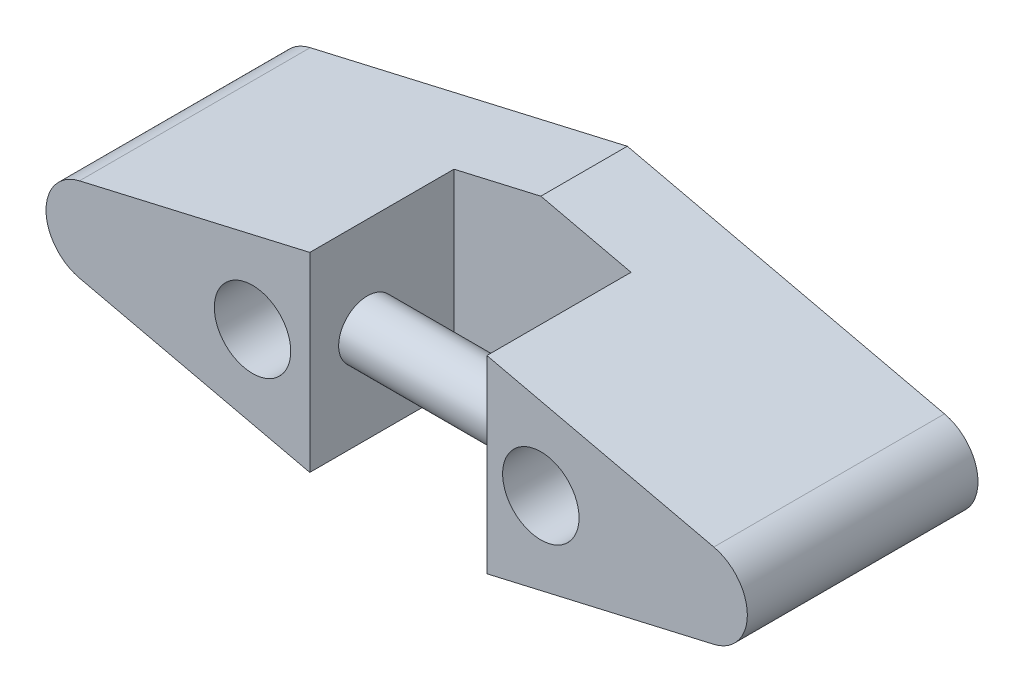
ISO-10303-21;
HEADER;
FILE_DESCRIPTION(('STEP AP214'),'2;1');
FILE_NAME('part.step','',(''),(''),'','','');
FILE_SCHEMA(('AUTOMOTIVE_DESIGN { 1 0 10303 214 1 1 1 1 }'));
ENDSEC;
DATA;
#1=APPLICATION_CONTEXT('core data for automotive mechanical design processes');
#2=APPLICATION_PROTOCOL_DEFINITION('international standard','automotive_design',2000,#1);
#3=PRODUCT_CONTEXT('',#1,'mechanical');
#4=PRODUCT('Part','Part','',(#3));
#5=PRODUCT_RELATED_PRODUCT_CATEGORY('part','',(#4));
#6=PRODUCT_DEFINITION_FORMATION('','',#4);
#7=PRODUCT_DEFINITION_CONTEXT('part definition',#1,'design');
#8=PRODUCT_DEFINITION('design','',#6,#7);
#9=PRODUCT_DEFINITION_SHAPE('','',#8);
#10=(LENGTH_UNIT() NAMED_UNIT(*) SI_UNIT(.MILLI.,.METRE.));
#11=(NAMED_UNIT(*) PLANE_ANGLE_UNIT() SI_UNIT($,.RADIAN.));
#12=(NAMED_UNIT(*) SI_UNIT($,.STERADIAN.) SOLID_ANGLE_UNIT());
#13=UNCERTAINTY_MEASURE_WITH_UNIT(LENGTH_MEASURE(1.E-05),#10,'distance_accuracy_value','');
#14=(GEOMETRIC_REPRESENTATION_CONTEXT(3) GLOBAL_UNCERTAINTY_ASSIGNED_CONTEXT((#13)) GLOBAL_UNIT_ASSIGNED_CONTEXT((#10,
#11,#12)) REPRESENTATION_CONTEXT('',''));
#15=CARTESIAN_POINT('',(0.,0.,0.));
#16=DIRECTION('',(0.,0.,1.));
#17=DIRECTION('',(1.,0.,0.));
#18=AXIS2_PLACEMENT_3D('',#15,#16,#17);
#19=CARTESIAN_POINT('',(-21.3253543461938,-0.000613334777528618,16.));
#20=DIRECTION('',(0.,0.,1.));
#21=DIRECTION('',(1.,0.,0.));
#22=AXIS2_PLACEMENT_3D('',#19,#20,#21);
#23=PLANE('',#22);
#24=CARTESIAN_POINT('',(10.,0.,16.));
#25=DIRECTION('',(0.,0.,1.));
#26=DIRECTION('',(1.,0.,0.));
#27=AXIS2_PLACEMENT_3D('',#24,#25,#26);
#28=CIRCLE('',#27,2.65);
#29=CARTESIAN_POINT('',(12.65,0.,16.));
#30=VERTEX_POINT('',#29);
#31=EDGE_CURVE('E172',#30,#30,#28,.T.);
#32=ORIENTED_EDGE('',*,*,#31,.F.);
#33=EDGE_LOOP('',(#32));
#34=FACE_BOUND('',#33,.T.);
#35=DIRECTION('',(-0.974386031292433,0.224881884602078,0.));
#36=VECTOR('',#35,1.);
#37=CARTESIAN_POINT('',(0.,8.,16.));
#38=LINE('',#37,#36);
#39=CARTESIAN_POINT('',(22.,2.92254475909978,16.));
#40=VERTEX_POINT('',#39);
#41=CARTESIAN_POINT('',(6.25777930061488,6.55574571334982,16.));
#42=VERTEX_POINT('',#41);
#43=EDGE_CURVE('E156',#40,#42,#38,.T.);
#44=ORIENTED_EDGE('',*,*,#43,.T.);
#45=DIRECTION('',(0.,-1.,0.));
#46=VECTOR('',#45,1.);
#47=CARTESIAN_POINT('',(6.25777930061488,13.086734885273,16.));
#48=LINE('',#47,#46);
#49=CARTESIAN_POINT('',(6.25777930061488,-6.55609463400198,16.));
#50=VERTEX_POINT('',#49);
#51=EDGE_CURVE('E150',#42,#50,#48,.T.);
#52=ORIENTED_EDGE('',*,*,#51,.T.);
#53=DIRECTION('',(0.974397934897183,0.224830301490048,0.));
#54=VECTOR('',#53,1.);
#55=CARTESIAN_POINT('',(21.9998452506639,-2.92380713946906,16.));
#56=LINE('',#55,#54);
#57=CARTESIAN_POINT('',(21.9998452506639,-2.92380713946906,16.));
#58=VERTEX_POINT('',#57);
#59=EDGE_CURVE('E102',#50,#58,#56,.T.);
#60=ORIENTED_EDGE('',*,*,#59,.T.);
#61=CARTESIAN_POINT('',(21.3253543461938,-0.00061333477751474,16.));
#62=DIRECTION('',(0.,0.,1.));
#63=DIRECTION('',(-1.,0.,0.));
#64=AXIS2_PLACEMENT_3D('',#61,#62,#63);
#65=CIRCLE('',#64,3.);
#66=EDGE_CURVE('E162',#58,#40,#65,.T.);
#67=ORIENTED_EDGE('',*,*,#66,.T.);
#68=EDGE_LOOP('',(#44,#52,#60,#67));
#69=FACE_BOUND('',#68,.T.);
#70=ADVANCED_FACE('F41',(#34,#69),#23,.T.);
#71=CARTESIAN_POINT('',(21.9998452506639,-2.92380713946906,16.));
#72=DIRECTION('',(-0.224830301490048,0.974397934897183,0.));
#73=DIRECTION('',(-0.974397934897183,-0.224830301490048,0.));
#74=AXIS2_PLACEMENT_3D('',#71,#72,#73);
#75=PLANE('',#74);
#76=DIRECTION('',(0.,0.,1.));
#77=VECTOR('',#76,1.);
#78=CARTESIAN_POINT('',(6.25777930061489,-6.55609463400198,16.));
#79=LINE('',#78,#77);
#80=CARTESIAN_POINT('',(6.25777930061488,-6.55609463400198,6.));
#81=VERTEX_POINT('',#80);
#82=EDGE_CURVE('E139',#81,#50,#79,.T.);
#83=ORIENTED_EDGE('',*,*,#82,.F.);
#84=DIRECTION('',(-0.974397934897183,-0.224830301490048,0.));
#85=VECTOR('',#84,1.);
#86=CARTESIAN_POINT('',(21.9998452506639,-2.92380713946906,6.));
#87=LINE('',#86,#85);
#88=CARTESIAN_POINT('',(0.,-8.00000000000001,6.));
#89=VERTEX_POINT('',#88);
#90=EDGE_CURVE('E224',#81,#89,#87,.T.);
#91=ORIENTED_EDGE('',*,*,#90,.T.);
#92=DIRECTION('',(0.,0.,-1.));
#93=VECTOR('',#92,1.);
#94=CARTESIAN_POINT('',(0.,-8.,16.));
#95=LINE('',#94,#93);
#96=CARTESIAN_POINT('',(0.,-8.,0.));
#97=VERTEX_POINT('',#96);
#98=EDGE_CURVE('E94',#89,#97,#95,.T.);
#99=ORIENTED_EDGE('',*,*,#98,.T.);
#100=DIRECTION('',(0.974397934897183,0.224830301490048,0.));
#101=VECTOR('',#100,1.);
#102=CARTESIAN_POINT('',(21.9998452506639,-2.92380713946906,0.));
#103=LINE('',#102,#101);
#104=CARTESIAN_POINT('',(21.9998452506639,-2.92380713946906,0.));
#105=VERTEX_POINT('',#104);
#106=EDGE_CURVE('E168',#97,#105,#103,.T.);
#107=ORIENTED_EDGE('',*,*,#106,.T.);
#108=DIRECTION('',(0.,0.,-1.));
#109=VECTOR('',#108,1.);
#110=CARTESIAN_POINT('',(21.9998452506639,-2.92380713946906,16.));
#111=LINE('',#110,#109);
#112=EDGE_CURVE('E203',#58,#105,#111,.T.);
#113=ORIENTED_EDGE('',*,*,#112,.F.);
#114=ORIENTED_EDGE('',*,*,#59,.F.);
#115=EDGE_LOOP('',(#83,#91,#99,#107,#113,#114));
#116=FACE_BOUND('',#115,.T.);
#117=ADVANCED_FACE('F43',(#116),#75,.F.);
#118=CARTESIAN_POINT('',(0.,8.,16.));
#119=DIRECTION('',(-0.224881884602078,-0.974386031292433,0.));
#120=DIRECTION('',(0.974386031292433,-0.224881884602078,0.));
#121=AXIS2_PLACEMENT_3D('',#118,#119,#120);
#122=PLANE('',#121);
#123=DIRECTION('',(0.,0.,-1.));
#124=VECTOR('',#123,1.);
#125=CARTESIAN_POINT('',(6.25777930061488,6.55574571334982,16.));
#126=LINE('',#125,#124);
#127=CARTESIAN_POINT('',(6.25777930061488,6.55574571334982,6.));
#128=VERTEX_POINT('',#127);
#129=EDGE_CURVE('E50',#42,#128,#126,.T.);
#130=ORIENTED_EDGE('',*,*,#129,.F.);
#131=ORIENTED_EDGE('',*,*,#43,.F.);
#132=DIRECTION('',(0.,0.,-1.));
#133=VECTOR('',#132,1.);
#134=CARTESIAN_POINT('',(22.,2.92254475909978,16.));
#135=LINE('',#134,#133);
#136=CARTESIAN_POINT('',(22.,2.92254475909978,0.));
#137=VERTEX_POINT('',#136);
#138=EDGE_CURVE('E199',#40,#137,#135,.T.);
#139=ORIENTED_EDGE('',*,*,#138,.T.);
#140=DIRECTION('',(-0.974386031292433,0.224881884602078,0.));
#141=VECTOR('',#140,1.);
#142=CARTESIAN_POINT('',(0.,8.,0.));
#143=LINE('',#142,#141);
#144=CARTESIAN_POINT('',(0.,8.,0.));
#145=VERTEX_POINT('',#144);
#146=EDGE_CURVE('E175',#137,#145,#143,.T.);
#147=ORIENTED_EDGE('',*,*,#146,.T.);
#148=DIRECTION('',(0.,0.,-1.));
#149=VECTOR('',#148,1.);
#150=CARTESIAN_POINT('',(0.,8.,16.));
#151=LINE('',#150,#149);
#152=CARTESIAN_POINT('',(0.,8.,6.));
#153=VERTEX_POINT('',#152);
#154=EDGE_CURVE('E196',#153,#145,#151,.T.);
#155=ORIENTED_EDGE('',*,*,#154,.F.);
#156=DIRECTION('',(0.974386031292433,-0.224881884602078,0.));
#157=VECTOR('',#156,1.);
#158=CARTESIAN_POINT('',(0.,8.,6.));
#159=LINE('',#158,#157);
#160=EDGE_CURVE('E140',#153,#128,#159,.T.);
#161=ORIENTED_EDGE('',*,*,#160,.T.);
#162=EDGE_LOOP('',(#130,#131,#139,#147,#155,#161));
#163=FACE_BOUND('',#162,.T.);
#164=ADVANCED_FACE('F228',(#163),#122,.F.);
#165=DIRECTION('',(0.,-1.,0.));
#166=VECTOR('',#165,1.);
#167=CARTESIAN_POINT('',(-6.02601921171342,13.086734885273,16.));
#168=LINE('',#167,#166);
#169=CARTESIAN_POINT('',(-6.02601921171342,6.60923441689637,16.));
#170=VERTEX_POINT('',#169);
#171=CARTESIAN_POINT('',(-6.02601921171342,-6.60957041509195,16.));
#172=VERTEX_POINT('',#171);
#173=EDGE_CURVE('E133',#170,#172,#168,.T.);
#174=ORIENTED_EDGE('',*,*,#173,.F.);
#175=DIRECTION('',(-0.974386031292433,-0.224881884602079,0.));
#176=VECTOR('',#175,1.);
#177=CARTESIAN_POINT('',(0.,8.,16.));
#178=LINE('',#177,#176);
#179=CARTESIAN_POINT('',(-22.,2.92254475909977,16.));
#180=VERTEX_POINT('',#179);
#181=EDGE_CURVE('E144',#170,#180,#178,.T.);
#182=ORIENTED_EDGE('',*,*,#181,.T.);
#183=CARTESIAN_POINT('',(-21.3253543461938,-0.000613334777528618,16.));
#184=DIRECTION('',(0.,0.,1.));
#185=DIRECTION('',(1.,0.,0.));
#186=AXIS2_PLACEMENT_3D('',#183,#184,#185);
#187=CIRCLE('',#186,3.);
#188=CARTESIAN_POINT('',(-21.9998452506639,-2.92380713946908,16.));
#189=VERTEX_POINT('',#188);
#190=EDGE_CURVE('E66',#180,#189,#187,.T.);
#191=ORIENTED_EDGE('',*,*,#190,.T.);
#192=DIRECTION('',(0.974397934897183,-0.224830301490047,0.));
#193=VECTOR('',#192,1.);
#194=CARTESIAN_POINT('',(-21.9998452506639,-2.92380713946908,16.));
#195=LINE('',#194,#193);
#196=EDGE_CURVE('E147',#189,#172,#195,.T.);
#197=ORIENTED_EDGE('',*,*,#196,.T.);
#198=EDGE_LOOP('',(#174,#182,#191,#197));
#199=FACE_BOUND('',#198,.T.);
#200=CARTESIAN_POINT('',(-10.,0.,16.));
#201=DIRECTION('',(0.,0.,1.));
#202=DIRECTION('',(1.,0.,0.));
#203=AXIS2_PLACEMENT_3D('',#200,#201,#202);
#204=CIRCLE('',#203,2.65);
#205=CARTESIAN_POINT('',(-7.35,0.,16.));
#206=VERTEX_POINT('',#205);
#207=EDGE_CURVE('E239',#206,#206,#204,.T.);
#208=ORIENTED_EDGE('',*,*,#207,.F.);
#209=EDGE_LOOP('',(#208));
#210=FACE_BOUND('',#209,.T.);
#211=ADVANCED_FACE('F142',(#199,#210),#23,.T.);
#212=CARTESIAN_POINT('',(-21.3253543461938,-0.000613334777528618,0.));
#213=DIRECTION('',(0.,0.,1.));
#214=DIRECTION('',(1.,0.,0.));
#215=AXIS2_PLACEMENT_3D('',#212,#213,#214);
#216=PLANE('',#215);
#217=ORIENTED_EDGE('',*,*,#106,.F.);
#218=DIRECTION('',(0.974397934897183,-0.224830301490047,0.));
#219=VECTOR('',#218,1.);
#220=CARTESIAN_POINT('',(-21.9998452506639,-2.92380713946908,0.));
#221=LINE('',#220,#219);
#222=CARTESIAN_POINT('',(-21.9998452506639,-2.92380713946908,0.));
#223=VERTEX_POINT('',#222);
#224=EDGE_CURVE('E185',#223,#97,#221,.T.);
#225=ORIENTED_EDGE('',*,*,#224,.F.);
#226=CARTESIAN_POINT('',(-21.3253543461938,-0.000613334777528618,0.));
#227=DIRECTION('',(0.,0.,1.));
#228=DIRECTION('',(1.,0.,0.));
#229=AXIS2_PLACEMENT_3D('',#226,#227,#228);
#230=CIRCLE('',#229,3.);
#231=CARTESIAN_POINT('',(-22.,2.92254475909977,0.));
#232=VERTEX_POINT('',#231);
#233=EDGE_CURVE('E182',#232,#223,#230,.T.);
#234=ORIENTED_EDGE('',*,*,#233,.F.);
#235=DIRECTION('',(-0.974386031292433,-0.224881884602079,0.));
#236=VECTOR('',#235,1.);
#237=CARTESIAN_POINT('',(0.,8.,0.));
#238=LINE('',#237,#236);
#239=EDGE_CURVE('E179',#145,#232,#238,.T.);
#240=ORIENTED_EDGE('',*,*,#239,.F.);
#241=ORIENTED_EDGE('',*,*,#146,.F.);
#242=CARTESIAN_POINT('',(21.3253543461938,-0.00061333477751474,0.));
#243=DIRECTION('',(0.,0.,1.));
#244=DIRECTION('',(-1.,0.,0.));
#245=AXIS2_PLACEMENT_3D('',#242,#243,#244);
#246=CIRCLE('',#245,3.);
#247=EDGE_CURVE('E171',#105,#137,#246,.T.);
#248=ORIENTED_EDGE('',*,*,#247,.F.);
#249=EDGE_LOOP('',(#217,#225,#234,#240,#241,#248));
#250=FACE_BOUND('',#249,.T.);
#251=CARTESIAN_POINT('',(10.,0.,0.));
#252=DIRECTION('',(0.,0.,1.));
#253=DIRECTION('',(1.,0.,0.));
#254=AXIS2_PLACEMENT_3D('',#251,#252,#253);
#255=CIRCLE('',#254,2.65);
#256=CARTESIAN_POINT('',(12.65,0.,0.));
#257=VERTEX_POINT('',#256);
#258=EDGE_CURVE('E243',#257,#257,#255,.T.);
#259=ORIENTED_EDGE('',*,*,#258,.T.);
#260=EDGE_LOOP('',(#259));
#261=FACE_BOUND('',#260,.T.);
#262=CARTESIAN_POINT('',(-10.,0.,0.));
#263=DIRECTION('',(0.,0.,1.));
#264=DIRECTION('',(1.,0.,0.));
#265=AXIS2_PLACEMENT_3D('',#262,#263,#264);
#266=CIRCLE('',#265,2.65);
#267=CARTESIAN_POINT('',(-7.35,0.,0.));
#268=VERTEX_POINT('',#267);
#269=EDGE_CURVE('E238',#268,#268,#266,.T.);
#270=ORIENTED_EDGE('',*,*,#269,.T.);
#271=EDGE_LOOP('',(#270));
#272=FACE_BOUND('',#271,.T.);
#273=ADVANCED_FACE('F263',(#250,#261,#272),#216,.F.);
#274=CARTESIAN_POINT('',(21.3253543461938,-0.00061333477751474,16.));
#275=DIRECTION('',(0.,0.,-1.));
#276=DIRECTION('',(-1.,0.,0.));
#277=AXIS2_PLACEMENT_3D('',#274,#275,#276);
#278=CYLINDRICAL_SURFACE('',#277,3.);
#279=ORIENTED_EDGE('',*,*,#247,.T.);
#280=ORIENTED_EDGE('',*,*,#138,.F.);
#281=ORIENTED_EDGE('',*,*,#66,.F.);
#282=ORIENTED_EDGE('',*,*,#112,.T.);
#283=EDGE_LOOP('',(#279,#280,#281,#282));
#284=FACE_BOUND('',#283,.T.);
#285=ADVANCED_FACE('F258',(#284),#278,.T.);
#286=CARTESIAN_POINT('',(0.,8.,16.));
#287=DIRECTION('',(0.224881884602079,-0.974386031292432,0.));
#288=DIRECTION('',(0.974386031292433,0.224881884602079,0.));
#289=AXIS2_PLACEMENT_3D('',#286,#287,#288);
#290=PLANE('',#289);
#291=ORIENTED_EDGE('',*,*,#181,.F.);
#292=DIRECTION('',(0.,0.,-1.));
#293=VECTOR('',#292,1.);
#294=CARTESIAN_POINT('',(-6.02601921171342,6.60923441689637,16.));
#295=LINE('',#294,#293);
#296=CARTESIAN_POINT('',(-6.02601921171342,6.60923441689637,6.));
#297=VERTEX_POINT('',#296);
#298=EDGE_CURVE('E130',#170,#297,#295,.T.);
#299=ORIENTED_EDGE('',*,*,#298,.T.);
#300=DIRECTION('',(0.974386031292433,0.224881884602079,0.));
#301=VECTOR('',#300,1.);
#302=CARTESIAN_POINT('',(0.,8.,6.));
#303=LINE('',#302,#301);
#304=EDGE_CURVE('E230',#297,#153,#303,.T.);
#305=ORIENTED_EDGE('',*,*,#304,.T.);
#306=ORIENTED_EDGE('',*,*,#154,.T.);
#307=ORIENTED_EDGE('',*,*,#239,.T.);
#308=DIRECTION('',(0.,0.,-1.));
#309=VECTOR('',#308,1.);
#310=CARTESIAN_POINT('',(-22.,2.92254475909977,16.));
#311=LINE('',#310,#309);
#312=EDGE_CURVE('E154',#180,#232,#311,.T.);
#313=ORIENTED_EDGE('',*,*,#312,.F.);
#314=EDGE_LOOP('',(#291,#299,#305,#306,#307,#313));
#315=FACE_BOUND('',#314,.T.);
#316=ADVANCED_FACE('F152',(#315),#290,.F.);
#317=CARTESIAN_POINT('',(-21.3253543461938,-0.000613334777528618,16.));
#318=DIRECTION('',(0.,0.,-1.));
#319=DIRECTION('',(-1.,0.,0.));
#320=AXIS2_PLACEMENT_3D('',#317,#318,#319);
#321=CYLINDRICAL_SURFACE('',#320,3.);
#322=ORIENTED_EDGE('',*,*,#233,.T.);
#323=DIRECTION('',(0.,0.,-1.));
#324=VECTOR('',#323,1.);
#325=CARTESIAN_POINT('',(-21.9998452506639,-2.92380713946908,16.));
#326=LINE('',#325,#324);
#327=EDGE_CURVE('E190',#189,#223,#326,.T.);
#328=ORIENTED_EDGE('',*,*,#327,.F.);
#329=ORIENTED_EDGE('',*,*,#190,.F.);
#330=ORIENTED_EDGE('',*,*,#312,.T.);
#331=EDGE_LOOP('',(#322,#328,#329,#330));
#332=FACE_BOUND('',#331,.T.);
#333=ADVANCED_FACE('F268',(#332),#321,.T.);
#334=CARTESIAN_POINT('',(-21.9998452506639,-2.92380713946908,16.));
#335=DIRECTION('',(0.224830301490047,0.974397934897183,0.));
#336=DIRECTION('',(-0.974397934897183,0.224830301490047,0.));
#337=AXIS2_PLACEMENT_3D('',#334,#335,#336);
#338=PLANE('',#337);
#339=DIRECTION('',(-0.974397934897183,0.224830301490047,0.));
#340=VECTOR('',#339,1.);
#341=CARTESIAN_POINT('',(-21.9998452506639,-2.92380713946908,6.));
#342=LINE('',#341,#340);
#343=CARTESIAN_POINT('',(-6.02601921171342,-6.60957041509195,6.));
#344=VERTEX_POINT('',#343);
#345=EDGE_CURVE('E207',#89,#344,#342,.T.);
#346=ORIENTED_EDGE('',*,*,#345,.T.);
#347=DIRECTION('',(0.,0.,1.));
#348=VECTOR('',#347,1.);
#349=CARTESIAN_POINT('',(-6.02601921171342,-6.60957041509196,16.));
#350=LINE('',#349,#348);
#351=EDGE_CURVE('E211',#344,#172,#350,.T.);
#352=ORIENTED_EDGE('',*,*,#351,.T.);
#353=ORIENTED_EDGE('',*,*,#196,.F.);
#354=ORIENTED_EDGE('',*,*,#327,.T.);
#355=ORIENTED_EDGE('',*,*,#224,.T.);
#356=ORIENTED_EDGE('',*,*,#98,.F.);
#357=EDGE_LOOP('',(#346,#352,#353,#354,#355,#356));
#358=FACE_BOUND('',#357,.T.);
#359=ADVANCED_FACE('F270',(#358),#338,.F.);
#360=CARTESIAN_POINT('',(10.,0.,16.));
#361=DIRECTION('',(0.,0.,-1.));
#362=DIRECTION('',(-1.,0.,0.));
#363=AXIS2_PLACEMENT_3D('',#360,#361,#362);
#364=CYLINDRICAL_SURFACE('',#363,2.65);
#365=ORIENTED_EDGE('',*,*,#31,.T.);
#366=EDGE_LOOP('',(#365));
#367=FACE_BOUND('',#366,.T.);
#368=ORIENTED_EDGE('',*,*,#258,.F.);
#369=EDGE_LOOP('',(#368));
#370=FACE_BOUND('',#369,.T.);
#371=ADVANCED_FACE('F294',(#367,#370),#364,.F.);
#372=CARTESIAN_POINT('',(-10.,0.,16.));
#373=DIRECTION('',(0.,0.,-1.));
#374=DIRECTION('',(-1.,0.,0.));
#375=AXIS2_PLACEMENT_3D('',#372,#373,#374);
#376=CYLINDRICAL_SURFACE('',#375,2.65);
#377=ORIENTED_EDGE('',*,*,#207,.T.);
#378=EDGE_LOOP('',(#377));
#379=FACE_BOUND('',#378,.T.);
#380=ORIENTED_EDGE('',*,*,#269,.F.);
#381=EDGE_LOOP('',(#380));
#382=FACE_BOUND('',#381,.T.);
#383=ADVANCED_FACE('F286',(#379,#382),#376,.F.);
#384=CARTESIAN_POINT('',(6.25777930061488,13.086734885273,6.));
#385=DIRECTION('',(-1.,0.,0.));
#386=DIRECTION('',(0.,-1.,0.));
#387=AXIS2_PLACEMENT_3D('',#384,#385,#386);
#388=PLANE('',#387);
#389=CARTESIAN_POINT('',(6.25777930061488,0.000745713349820003,12.));
#390=DIRECTION('',(-1.,0.,0.));
#391=DIRECTION('',(0.,-1.,0.));
#392=AXIS2_PLACEMENT_3D('',#389,#390,#391);
#393=CIRCLE('',#392,2.);
#394=CARTESIAN_POINT('',(6.25777930061488,-1.99925428665018,12.));
#395=VERTEX_POINT('',#394);
#396=EDGE_CURVE('E276',#395,#395,#393,.T.);
#397=ORIENTED_EDGE('',*,*,#396,.F.);
#398=EDGE_LOOP('',(#397));
#399=FACE_BOUND('',#398,.T.);
#400=ORIENTED_EDGE('',*,*,#82,.T.);
#401=ORIENTED_EDGE('',*,*,#51,.F.);
#402=ORIENTED_EDGE('',*,*,#129,.T.);
#403=DIRECTION('',(0.,-1.,0.));
#404=VECTOR('',#403,1.);
#405=CARTESIAN_POINT('',(6.25777930061488,13.086734885273,6.));
#406=LINE('',#405,#404);
#407=EDGE_CURVE('E149',#128,#81,#406,.T.);
#408=ORIENTED_EDGE('',*,*,#407,.T.);
#409=EDGE_LOOP('',(#400,#401,#402,#408));
#410=FACE_BOUND('',#409,.T.);
#411=ADVANCED_FACE('F218',(#399,#410),#388,.T.);
#412=CARTESIAN_POINT('',(-6.02601921171342,13.086734885273,6.));
#413=DIRECTION('',(-1.,0.,0.));
#414=DIRECTION('',(0.,-1.,0.));
#415=AXIS2_PLACEMENT_3D('',#412,#413,#414);
#416=PLANE('',#415);
#417=CARTESIAN_POINT('',(-6.02601921171342,0.000745713349818488,12.));
#418=DIRECTION('',(-1.,0.,0.));
#419=DIRECTION('',(0.,-1.,0.));
#420=AXIS2_PLACEMENT_3D('',#417,#418,#419);
#421=CIRCLE('',#420,2.);
#422=CARTESIAN_POINT('',(-6.02601921171342,-1.99925428665018,12.));
#423=VERTEX_POINT('',#422);
#424=EDGE_CURVE('E11',#423,#423,#421,.F.);
#425=ORIENTED_EDGE('',*,*,#424,.F.);
#426=EDGE_LOOP('',(#425));
#427=FACE_BOUND('',#426,.T.);
#428=ORIENTED_EDGE('',*,*,#173,.T.);
#429=ORIENTED_EDGE('',*,*,#351,.F.);
#430=DIRECTION('',(0.,-1.,0.));
#431=VECTOR('',#430,1.);
#432=CARTESIAN_POINT('',(-6.02601921171342,13.086734885273,6.));
#433=LINE('',#432,#431);
#434=EDGE_CURVE('E57',#297,#344,#433,.T.);
#435=ORIENTED_EDGE('',*,*,#434,.F.);
#436=ORIENTED_EDGE('',*,*,#298,.F.);
#437=EDGE_LOOP('',(#428,#429,#435,#436));
#438=FACE_BOUND('',#437,.T.);
#439=ADVANCED_FACE('F132',(#427,#438),#416,.F.);
#440=CARTESIAN_POINT('',(0.,0.,6.));
#441=DIRECTION('',(0.,0.,-1.));
#442=DIRECTION('',(-1.,0.,0.));
#443=AXIS2_PLACEMENT_3D('',#440,#441,#442);
#444=PLANE('',#443);
#445=ORIENTED_EDGE('',*,*,#304,.F.);
#446=ORIENTED_EDGE('',*,*,#434,.T.);
#447=ORIENTED_EDGE('',*,*,#345,.F.);
#448=ORIENTED_EDGE('',*,*,#90,.F.);
#449=ORIENTED_EDGE('',*,*,#407,.F.);
#450=ORIENTED_EDGE('',*,*,#160,.F.);
#451=EDGE_LOOP('',(#445,#446,#447,#448,#449,#450));
#452=FACE_BOUND('',#451,.T.);
#453=ADVANCED_FACE('F223',(#452),#444,.F.);
#454=CARTESIAN_POINT('',(-24.3273543461938,0.000745713349816229,12.));
#455=DIRECTION('',(1.,0.,0.));
#456=DIRECTION('',(0.,1.,0.));
#457=AXIS2_PLACEMENT_3D('',#454,#455,#456);
#458=CYLINDRICAL_SURFACE('',#457,2.);
#459=ORIENTED_EDGE('',*,*,#396,.T.);
#460=EDGE_LOOP('',(#459));
#461=FACE_BOUND('',#460,.T.);
#462=ORIENTED_EDGE('',*,*,#424,.T.);
#463=EDGE_LOOP('',(#462));
#464=FACE_BOUND('',#463,.T.);
#465=ADVANCED_FACE('F282',(#461,#464),#458,.T.);
#466=CLOSED_SHELL('',(#70,#117,#164,#211,#273,#285,#316,#333,#359,#371,#383,#411,#439,#453,#465));
#467=MANIFOLD_SOLID_BREP('B2',#466);
#468=ADVANCED_BREP_SHAPE_REPRESENTATION('',(#18,#467),#14);
#469=SHAPE_DEFINITION_REPRESENTATION(#9,#468);
ENDSEC;
END-ISO-10303-21;
